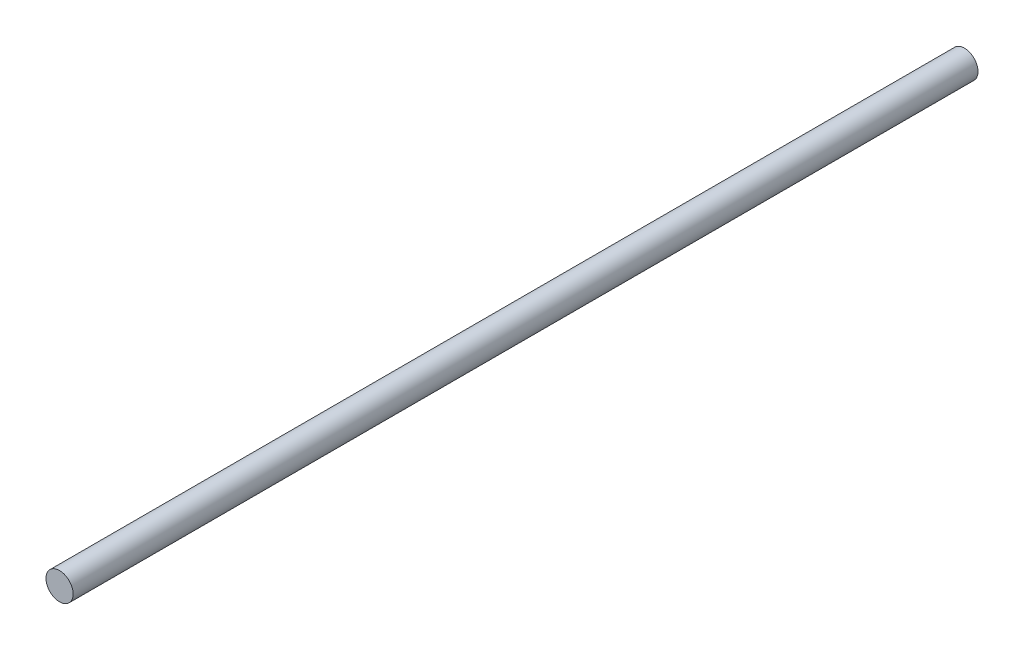
ISO-10303-21;
HEADER;
FILE_DESCRIPTION(('STEP AP214'),'2;1');
FILE_NAME('part.step','',(''),(''),'','','');
FILE_SCHEMA(('AUTOMOTIVE_DESIGN { 1 0 10303 214 1 1 1 1 }'));
ENDSEC;
DATA;
#1=APPLICATION_CONTEXT('core data for automotive mechanical design processes');
#2=APPLICATION_PROTOCOL_DEFINITION('international standard','automotive_design',2000,#1);
#3=PRODUCT_CONTEXT('',#1,'mechanical');
#4=PRODUCT('Part','Part','',(#3));
#5=PRODUCT_RELATED_PRODUCT_CATEGORY('part','',(#4));
#6=PRODUCT_DEFINITION_FORMATION('','',#4);
#7=PRODUCT_DEFINITION_CONTEXT('part definition',#1,'design');
#8=PRODUCT_DEFINITION('design','',#6,#7);
#9=PRODUCT_DEFINITION_SHAPE('','',#8);
#10=(LENGTH_UNIT() NAMED_UNIT(*) SI_UNIT(.MILLI.,.METRE.));
#11=(NAMED_UNIT(*) PLANE_ANGLE_UNIT() SI_UNIT($,.RADIAN.));
#12=(NAMED_UNIT(*) SI_UNIT($,.STERADIAN.) SOLID_ANGLE_UNIT());
#13=UNCERTAINTY_MEASURE_WITH_UNIT(LENGTH_MEASURE(1.E-05),#10,'distance_accuracy_value','');
#14=(GEOMETRIC_REPRESENTATION_CONTEXT(3) GLOBAL_UNCERTAINTY_ASSIGNED_CONTEXT((#13)) GLOBAL_UNIT_ASSIGNED_CONTEXT((#10,
#11,#12)) REPRESENTATION_CONTEXT('',''));
#15=CARTESIAN_POINT('',(0.,0.,0.));
#16=DIRECTION('',(0.,0.,1.));
#17=DIRECTION('',(1.,0.,0.));
#18=AXIS2_PLACEMENT_3D('',#15,#16,#17);
#19=CARTESIAN_POINT('',(0.,0.,400.));
#20=DIRECTION('',(0.,0.,-1.));
#21=DIRECTION('',(-1.,0.,0.));
#22=AXIS2_PLACEMENT_3D('',#19,#20,#21);
#23=CYLINDRICAL_SURFACE('',#22,6.);
#24=CARTESIAN_POINT('',(0.,0.,400.));
#25=DIRECTION('',(0.,0.,1.));
#26=DIRECTION('',(1.,0.,0.));
#27=AXIS2_PLACEMENT_3D('',#24,#25,#26);
#28=CIRCLE('',#27,6.);
#29=CARTESIAN_POINT('',(6.,0.,400.));
#30=VERTEX_POINT('',#29);
#31=EDGE_CURVE('E10',#30,#30,#28,.T.);
#32=ORIENTED_EDGE('',*,*,#31,.F.);
#33=EDGE_LOOP('',(#32));
#34=FACE_BOUND('',#33,.T.);
#35=CARTESIAN_POINT('',(0.,0.,0.));
#36=DIRECTION('',(0.,0.,1.));
#37=DIRECTION('',(1.,0.,0.));
#38=AXIS2_PLACEMENT_3D('',#35,#36,#37);
#39=CIRCLE('',#38,6.);
#40=CARTESIAN_POINT('',(6.,0.,0.));
#41=VERTEX_POINT('',#40);
#42=EDGE_CURVE('E34',#41,#41,#39,.T.);
#43=ORIENTED_EDGE('',*,*,#42,.T.);
#44=EDGE_LOOP('',(#43));
#45=FACE_BOUND('',#44,.T.);
#46=ADVANCED_FACE('F31',(#34,#45),#23,.T.);
#47=CARTESIAN_POINT('',(0.,0.,400.));
#48=DIRECTION('',(0.,0.,1.));
#49=DIRECTION('',(1.,0.,0.));
#50=AXIS2_PLACEMENT_3D('',#47,#48,#49);
#51=PLANE('',#50);
#52=ORIENTED_EDGE('',*,*,#31,.T.);
#53=EDGE_LOOP('',(#52));
#54=FACE_BOUND('',#53,.T.);
#55=ADVANCED_FACE('F46',(#54),#51,.T.);
#56=CARTESIAN_POINT('',(0.,0.,0.));
#57=DIRECTION('',(0.,0.,1.));
#58=DIRECTION('',(1.,0.,0.));
#59=AXIS2_PLACEMENT_3D('',#56,#57,#58);
#60=PLANE('',#59);
#61=ORIENTED_EDGE('',*,*,#42,.F.);
#62=EDGE_LOOP('',(#61));
#63=FACE_BOUND('',#62,.T.);
#64=ADVANCED_FACE('F44',(#63),#60,.F.);
#65=CLOSED_SHELL('',(#46,#55,#64));
#66=MANIFOLD_SOLID_BREP('B2',#65);
#67=ADVANCED_BREP_SHAPE_REPRESENTATION('',(#18,#66),#14);
#68=SHAPE_DEFINITION_REPRESENTATION(#9,#67);
ENDSEC;
END-ISO-10303-21;
